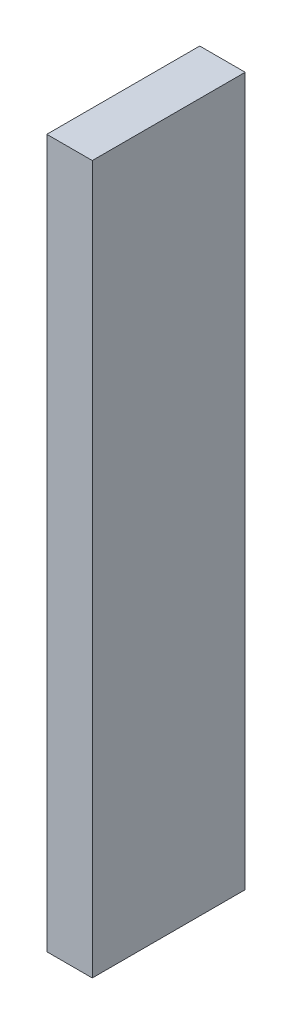
ISO-10303-21;
HEADER;
FILE_DESCRIPTION(('STEP AP214'),'2;1');
FILE_NAME('part.step','',(''),(''),'','','');
FILE_SCHEMA(('AUTOMOTIVE_DESIGN { 1 0 10303 214 1 1 1 1 }'));
ENDSEC;
DATA;
#1=APPLICATION_CONTEXT('core data for automotive mechanical design processes');
#2=APPLICATION_PROTOCOL_DEFINITION('international standard','automotive_design',2000,#1);
#3=PRODUCT_CONTEXT('',#1,'mechanical');
#4=PRODUCT('Part','Part','',(#3));
#5=PRODUCT_RELATED_PRODUCT_CATEGORY('part','',(#4));
#6=PRODUCT_DEFINITION_FORMATION('','',#4);
#7=PRODUCT_DEFINITION_CONTEXT('part definition',#1,'design');
#8=PRODUCT_DEFINITION('design','',#6,#7);
#9=PRODUCT_DEFINITION_SHAPE('','',#8);
#10=(LENGTH_UNIT() NAMED_UNIT(*) SI_UNIT(.MILLI.,.METRE.));
#11=(NAMED_UNIT(*) PLANE_ANGLE_UNIT() SI_UNIT($,.RADIAN.));
#12=(NAMED_UNIT(*) SI_UNIT($,.STERADIAN.) SOLID_ANGLE_UNIT());
#13=UNCERTAINTY_MEASURE_WITH_UNIT(LENGTH_MEASURE(1.E-05),#10,'distance_accuracy_value','');
#14=(GEOMETRIC_REPRESENTATION_CONTEXT(3) GLOBAL_UNCERTAINTY_ASSIGNED_CONTEXT((#13)) GLOBAL_UNIT_ASSIGNED_CONTEXT((#10,
#11,#12)) REPRESENTATION_CONTEXT('',''));
#15=CARTESIAN_POINT('',(0.,0.,0.));
#16=DIRECTION('',(0.,0.,1.));
#17=DIRECTION('',(1.,0.,0.));
#18=AXIS2_PLACEMENT_3D('',#15,#16,#17);
#19=CARTESIAN_POINT('',(130.275545133452,7.11212965552235,132.766087032048));
#20=DIRECTION('',(1.69244514382854E-09,0.,-1.));
#21=DIRECTION('',(-1.,0.,-1.69244514382854E-09));
#22=AXIS2_PLACEMENT_3D('',#19,#20,#21);
#23=PLANE('',#22);
#24=DIRECTION('',(0.,1.,0.));
#25=VECTOR('',#24,1.);
#26=CARTESIAN_POINT('',(131.258630230465,7.11212965552235,132.766087033712));
#27=LINE('',#26,#25);
#28=CARTESIAN_POINT('',(131.258630230465,7.11212965552235,132.766087033712));
#29=VERTEX_POINT('',#28);
#30=CARTESIAN_POINT('',(131.258630230465,22.418070826371,132.766087025251));
#31=VERTEX_POINT('',#30);
#32=EDGE_CURVE('E79',#29,#31,#27,.T.);
#33=ORIENTED_EDGE('',*,*,#32,.F.);
#34=DIRECTION('',(1.,0.,1.69244514382854E-09));
#35=VECTOR('',#34,1.);
#36=CARTESIAN_POINT('',(130.275545133452,7.11212965552235,132.766087032048));
#37=LINE('',#36,#35);
#38=CARTESIAN_POINT('',(130.275545133452,7.11212965552235,132.766087032048));
#39=VERTEX_POINT('',#38);
#40=EDGE_CURVE('E32',#39,#29,#37,.T.);
#41=ORIENTED_EDGE('',*,*,#40,.F.);
#42=DIRECTION('',(0.,1.,0.));
#43=VECTOR('',#42,1.);
#44=CARTESIAN_POINT('',(130.275545133452,7.11212965552235,132.766087032048));
#45=LINE('',#44,#43);
#46=CARTESIAN_POINT('',(130.275545133452,22.418070826371,132.766087023588));
#47=VERTEX_POINT('',#46);
#48=EDGE_CURVE('E71',#39,#47,#45,.T.);
#49=ORIENTED_EDGE('',*,*,#48,.T.);
#50=DIRECTION('',(1.,0.,1.69244514382854E-09));
#51=VECTOR('',#50,1.);
#52=CARTESIAN_POINT('',(130.275545133452,22.418070826371,132.766087023588));
#53=LINE('',#52,#51);
#54=EDGE_CURVE('E10',#47,#31,#53,.T.);
#55=ORIENTED_EDGE('',*,*,#54,.T.);
#56=EDGE_LOOP('',(#33,#41,#49,#55));
#57=FACE_BOUND('',#56,.T.);
#58=ADVANCED_FACE('F16',(#57),#23,.T.);
#59=CARTESIAN_POINT('',(130.275545133452,22.418070826371,132.766087023588));
#60=DIRECTION('',(0.,1.,0.));
#61=DIRECTION('',(-1.,0.,0.));
#62=AXIS2_PLACEMENT_3D('',#59,#60,#61);
#63=PLANE('',#62);
#64=DIRECTION('',(-1.69244514382854E-09,0.,1.));
#65=VECTOR('',#64,1.);
#66=CARTESIAN_POINT('',(131.258630230465,22.418070826371,132.766087025251));
#67=LINE('',#66,#65);
#68=CARTESIAN_POINT('',(131.25863022487,22.4180708263693,136.072028204561));
#69=VERTEX_POINT('',#68);
#70=EDGE_CURVE('E82',#31,#69,#67,.T.);
#71=ORIENTED_EDGE('',*,*,#70,.F.);
#72=ORIENTED_EDGE('',*,*,#54,.F.);
#73=DIRECTION('',(-1.69244514382854E-09,0.,1.));
#74=VECTOR('',#73,1.);
#75=CARTESIAN_POINT('',(130.275545133452,22.418070826371,132.766087023588));
#76=LINE('',#75,#74);
#77=CARTESIAN_POINT('',(130.275545127857,22.4180708263693,136.072028202897));
#78=VERTEX_POINT('',#77);
#79=EDGE_CURVE('E67',#47,#78,#76,.T.);
#80=ORIENTED_EDGE('',*,*,#79,.T.);
#81=DIRECTION('',(1.,0.,1.69244514382854E-09));
#82=VECTOR('',#81,1.);
#83=CARTESIAN_POINT('',(130.275545127857,22.4180708263693,136.072028202897));
#84=LINE('',#83,#82);
#85=EDGE_CURVE('E24',#78,#69,#84,.T.);
#86=ORIENTED_EDGE('',*,*,#85,.T.);
#87=EDGE_LOOP('',(#71,#72,#80,#86));
#88=FACE_BOUND('',#87,.T.);
#89=ADVANCED_FACE('F68',(#88),#63,.T.);
#90=CARTESIAN_POINT('',(130.275545127857,22.4180708263693,136.072028202897));
#91=DIRECTION('',(-1.69244514382854E-09,0.,1.));
#92=DIRECTION('',(1.,0.,1.69244514382854E-09));
#93=AXIS2_PLACEMENT_3D('',#90,#91,#92);
#94=PLANE('',#93);
#95=DIRECTION('',(0.,-1.,0.));
#96=VECTOR('',#95,1.);
#97=CARTESIAN_POINT('',(131.25863022487,22.4180708263693,136.072028204561));
#98=LINE('',#97,#96);
#99=CARTESIAN_POINT('',(131.25863022487,7.11212965552235,136.072028204561));
#100=VERTEX_POINT('',#99);
#101=EDGE_CURVE('E65',#69,#100,#98,.T.);
#102=ORIENTED_EDGE('',*,*,#101,.F.);
#103=ORIENTED_EDGE('',*,*,#85,.F.);
#104=DIRECTION('',(0.,-1.,0.));
#105=VECTOR('',#104,1.);
#106=CARTESIAN_POINT('',(130.275545127857,22.4180708263693,136.072028202897));
#107=LINE('',#106,#105);
#108=CARTESIAN_POINT('',(130.275545127857,7.11212965552235,136.072028202897));
#109=VERTEX_POINT('',#108);
#110=EDGE_CURVE('E62',#78,#109,#107,.T.);
#111=ORIENTED_EDGE('',*,*,#110,.T.);
#112=DIRECTION('',(1.,0.,1.69244514382854E-09));
#113=VECTOR('',#112,1.);
#114=CARTESIAN_POINT('',(130.275545127857,7.11212965552235,136.072028202897));
#115=LINE('',#114,#113);
#116=EDGE_CURVE('E48',#109,#100,#115,.T.);
#117=ORIENTED_EDGE('',*,*,#116,.T.);
#118=EDGE_LOOP('',(#102,#103,#111,#117));
#119=FACE_BOUND('',#118,.T.);
#120=ADVANCED_FACE('F60',(#119),#94,.T.);
#121=CARTESIAN_POINT('',(130.275545127857,7.11212965552235,136.072028202897));
#122=DIRECTION('',(0.,-1.,0.));
#123=DIRECTION('',(0.,0.,-1.));
#124=AXIS2_PLACEMENT_3D('',#121,#122,#123);
#125=PLANE('',#124);
#126=DIRECTION('',(1.69244514382854E-09,0.,-1.));
#127=VECTOR('',#126,1.);
#128=CARTESIAN_POINT('',(131.25863022487,7.11212965552235,136.072028204561));
#129=LINE('',#128,#127);
#130=EDGE_CURVE('E85',#100,#29,#129,.T.);
#131=ORIENTED_EDGE('',*,*,#130,.F.);
#132=ORIENTED_EDGE('',*,*,#116,.F.);
#133=DIRECTION('',(1.69244514382854E-09,0.,-1.));
#134=VECTOR('',#133,1.);
#135=CARTESIAN_POINT('',(130.275545127857,7.11212965552235,136.072028202897));
#136=LINE('',#135,#134);
#137=EDGE_CURVE('E74',#109,#39,#136,.T.);
#138=ORIENTED_EDGE('',*,*,#137,.T.);
#139=ORIENTED_EDGE('',*,*,#40,.T.);
#140=EDGE_LOOP('',(#131,#132,#138,#139));
#141=FACE_BOUND('',#140,.T.);
#142=ADVANCED_FACE('F96',(#141),#125,.T.);
#143=CARTESIAN_POINT('',(130.275545201028,17.2651002409467,92.8378644340291));
#144=DIRECTION('',(1.,0.,1.69244514382854E-09));
#145=DIRECTION('',(0.,1.,0.));
#146=AXIS2_PLACEMENT_3D('',#143,#144,#145);
#147=PLANE('',#146);
#148=ORIENTED_EDGE('',*,*,#48,.F.);
#149=ORIENTED_EDGE('',*,*,#137,.F.);
#150=ORIENTED_EDGE('',*,*,#110,.F.);
#151=ORIENTED_EDGE('',*,*,#79,.F.);
#152=EDGE_LOOP('',(#148,#149,#150,#151));
#153=FACE_BOUND('',#152,.T.);
#154=ADVANCED_FACE('F73',(#153),#147,.F.);
#155=CARTESIAN_POINT('',(131.258630298041,17.2651002409467,92.8378644356929));
#156=DIRECTION('',(1.,0.,1.69244514382854E-09));
#157=DIRECTION('',(0.,1.,0.));
#158=AXIS2_PLACEMENT_3D('',#155,#156,#157);
#159=PLANE('',#158);
#160=ORIENTED_EDGE('',*,*,#32,.T.);
#161=ORIENTED_EDGE('',*,*,#70,.T.);
#162=ORIENTED_EDGE('',*,*,#101,.T.);
#163=ORIENTED_EDGE('',*,*,#130,.T.);
#164=EDGE_LOOP('',(#160,#161,#162,#163));
#165=FACE_BOUND('',#164,.T.);
#166=ADVANCED_FACE('F89',(#165),#159,.T.);
#167=CLOSED_SHELL('',(#58,#89,#120,#142,#154,#166));
#168=MANIFOLD_SOLID_BREP('B1',#167);
#169=ADVANCED_BREP_SHAPE_REPRESENTATION('',(#18,#168),#14);
#170=SHAPE_DEFINITION_REPRESENTATION(#9,#169);
ENDSEC;
END-ISO-10303-21;
